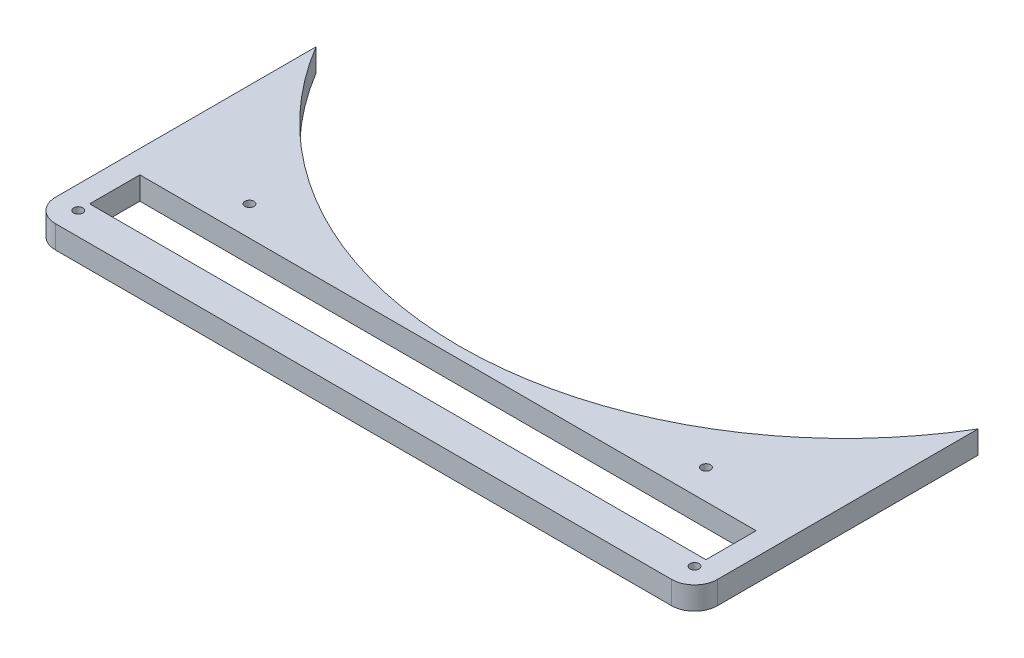
ISO-10303-21;
HEADER;
FILE_DESCRIPTION(('STEP AP214'),'2;1');
FILE_NAME('part.step','',(''),(''),'','','');
FILE_SCHEMA(('AUTOMOTIVE_DESIGN { 1 0 10303 214 1 1 1 1 }'));
ENDSEC;
DATA;
#1=APPLICATION_CONTEXT('core data for automotive mechanical design processes');
#2=APPLICATION_PROTOCOL_DEFINITION('international standard','automotive_design',2000,#1);
#3=PRODUCT_CONTEXT('',#1,'mechanical');
#4=PRODUCT('Part','Part','',(#3));
#5=PRODUCT_RELATED_PRODUCT_CATEGORY('part','',(#4));
#6=PRODUCT_DEFINITION_FORMATION('','',#4);
#7=PRODUCT_DEFINITION_CONTEXT('part definition',#1,'design');
#8=PRODUCT_DEFINITION('design','',#6,#7);
#9=PRODUCT_DEFINITION_SHAPE('','',#8);
#10=(LENGTH_UNIT() NAMED_UNIT(*) SI_UNIT(.MILLI.,.METRE.));
#11=(NAMED_UNIT(*) PLANE_ANGLE_UNIT() SI_UNIT($,.RADIAN.));
#12=(NAMED_UNIT(*) SI_UNIT($,.STERADIAN.) SOLID_ANGLE_UNIT());
#13=UNCERTAINTY_MEASURE_WITH_UNIT(LENGTH_MEASURE(1.E-05),#10,'distance_accuracy_value','');
#14=(GEOMETRIC_REPRESENTATION_CONTEXT(3) GLOBAL_UNCERTAINTY_ASSIGNED_CONTEXT((#13)) GLOBAL_UNIT_ASSIGNED_CONTEXT((#10,
#11,#12)) REPRESENTATION_CONTEXT('',''));
#15=CARTESIAN_POINT('',(0.,0.,0.));
#16=DIRECTION('',(0.,0.,1.));
#17=DIRECTION('',(1.,0.,0.));
#18=AXIS2_PLACEMENT_3D('',#15,#16,#17);
#19=CARTESIAN_POINT('',(280.,0.,-10.));
#20=DIRECTION('',(0.,1.,0.));
#21=DIRECTION('',(0.,0.,1.));
#22=AXIS2_PLACEMENT_3D('',#19,#20,#21);
#23=CYLINDRICAL_SURFACE('',#22,2.);
#24=CARTESIAN_POINT('',(280.,10.,-10.));
#25=DIRECTION('',(0.,1.,0.));
#26=DIRECTION('',(0.,0.,-1.));
#27=AXIS2_PLACEMENT_3D('',#24,#25,#26);
#28=CIRCLE('',#27,2.);
#29=CARTESIAN_POINT('',(280.,10.,-12.));
#30=VERTEX_POINT('',#29);
#31=EDGE_CURVE('E181',#30,#30,#28,.T.);
#32=ORIENTED_EDGE('',*,*,#31,.T.);
#33=EDGE_LOOP('',(#32));
#34=FACE_BOUND('',#33,.T.);
#35=CARTESIAN_POINT('',(280.,5.,-10.));
#36=DIRECTION('',(0.,-1.,0.));
#37=DIRECTION('',(0.,0.,-1.));
#38=AXIS2_PLACEMENT_3D('',#35,#36,#37);
#39=CIRCLE('',#38,2.);
#40=CARTESIAN_POINT('',(280.,5.,-12.));
#41=VERTEX_POINT('',#40);
#42=EDGE_CURVE('E142',#41,#41,#39,.F.);
#43=ORIENTED_EDGE('',*,*,#42,.F.);
#44=EDGE_LOOP('',(#43));
#45=FACE_BOUND('',#44,.T.);
#46=ADVANCED_FACE('F33',(#34,#45),#23,.F.);
#47=CARTESIAN_POINT('',(245.,0.,-50.));
#48=DIRECTION('',(0.,1.,0.));
#49=DIRECTION('',(0.,0.,1.));
#50=AXIS2_PLACEMENT_3D('',#47,#48,#49);
#51=CYLINDRICAL_SURFACE('',#50,2.00000000000002);
#52=CARTESIAN_POINT('',(245.,10.,-50.));
#53=DIRECTION('',(0.,1.,0.));
#54=DIRECTION('',(0.,0.,-1.));
#55=AXIS2_PLACEMENT_3D('',#52,#53,#54);
#56=CIRCLE('',#55,2.00000000000002);
#57=CARTESIAN_POINT('',(245.,10.,-52.));
#58=VERTEX_POINT('',#57);
#59=EDGE_CURVE('E276',#58,#58,#56,.T.);
#60=ORIENTED_EDGE('',*,*,#59,.T.);
#61=EDGE_LOOP('',(#60));
#62=FACE_BOUND('',#61,.T.);
#63=CARTESIAN_POINT('',(245.,5.,-50.));
#64=DIRECTION('',(0.,-1.,0.));
#65=DIRECTION('',(0.,0.,-1.));
#66=AXIS2_PLACEMENT_3D('',#63,#64,#65);
#67=CIRCLE('',#66,2.00000000000002);
#68=CARTESIAN_POINT('',(245.,5.,-52.));
#69=VERTEX_POINT('',#68);
#70=EDGE_CURVE('E237',#69,#69,#67,.F.);
#71=ORIENTED_EDGE('',*,*,#70,.F.);
#72=EDGE_LOOP('',(#71));
#73=FACE_BOUND('',#72,.T.);
#74=ADVANCED_FACE('F301',(#62,#73),#51,.F.);
#75=CARTESIAN_POINT('',(45.,0.,-50.));
#76=DIRECTION('',(0.,1.,0.));
#77=DIRECTION('',(0.,0.,1.));
#78=AXIS2_PLACEMENT_3D('',#75,#76,#77);
#79=CYLINDRICAL_SURFACE('',#78,2.);
#80=CARTESIAN_POINT('',(45.,10.,-50.));
#81=DIRECTION('',(0.,1.,0.));
#82=DIRECTION('',(0.,0.,1.));
#83=AXIS2_PLACEMENT_3D('',#80,#81,#82);
#84=CIRCLE('',#83,2.);
#85=CARTESIAN_POINT('',(45.,10.,-48.));
#86=VERTEX_POINT('',#85);
#87=EDGE_CURVE('E271',#86,#86,#84,.T.);
#88=ORIENTED_EDGE('',*,*,#87,.T.);
#89=EDGE_LOOP('',(#88));
#90=FACE_BOUND('',#89,.T.);
#91=CARTESIAN_POINT('',(45.,5.,-50.));
#92=DIRECTION('',(0.,-1.,0.));
#93=DIRECTION('',(0.,0.,-1.));
#94=AXIS2_PLACEMENT_3D('',#91,#92,#93);
#95=CIRCLE('',#94,2.);
#96=CARTESIAN_POINT('',(45.,5.,-52.));
#97=VERTEX_POINT('',#96);
#98=EDGE_CURVE('E232',#97,#97,#95,.F.);
#99=ORIENTED_EDGE('',*,*,#98,.F.);
#100=EDGE_LOOP('',(#99));
#101=FACE_BOUND('',#100,.T.);
#102=ADVANCED_FACE('F307',(#90,#101),#79,.F.);
#103=CARTESIAN_POINT('',(10.,0.,-10.));
#104=DIRECTION('',(0.,1.,0.));
#105=DIRECTION('',(0.,0.,1.));
#106=AXIS2_PLACEMENT_3D('',#103,#104,#105);
#107=CYLINDRICAL_SURFACE('',#106,2.);
#108=CARTESIAN_POINT('',(10.,10.,-10.));
#109=DIRECTION('',(0.,1.,0.));
#110=DIRECTION('',(0.,0.,1.));
#111=AXIS2_PLACEMENT_3D('',#108,#109,#110);
#112=CIRCLE('',#111,2.);
#113=CARTESIAN_POINT('',(10.,10.,-8.));
#114=VERTEX_POINT('',#113);
#115=EDGE_CURVE('E188',#114,#114,#112,.T.);
#116=ORIENTED_EDGE('',*,*,#115,.T.);
#117=EDGE_LOOP('',(#116));
#118=FACE_BOUND('',#117,.T.);
#119=CARTESIAN_POINT('',(10.,5.,-10.));
#120=DIRECTION('',(0.,-1.,0.));
#121=DIRECTION('',(0.,0.,-1.));
#122=AXIS2_PLACEMENT_3D('',#119,#120,#121);
#123=CIRCLE('',#122,2.);
#124=CARTESIAN_POINT('',(10.,5.,-12.));
#125=VERTEX_POINT('',#124);
#126=EDGE_CURVE('E281',#125,#125,#123,.F.);
#127=ORIENTED_EDGE('',*,*,#126,.F.);
#128=EDGE_LOOP('',(#127));
#129=FACE_BOUND('',#128,.T.);
#130=ADVANCED_FACE('F314',(#118,#129),#107,.F.);
#131=CARTESIAN_POINT('',(0.,10.,0.));
#132=DIRECTION('',(1.,0.,0.));
#133=DIRECTION('',(0.,0.,-1.));
#134=AXIS2_PLACEMENT_3D('',#131,#132,#133);
#135=PLANE('',#134);
#136=DIRECTION('',(0.,0.,1.));
#137=VECTOR('',#136,1.);
#138=CARTESIAN_POINT('',(0.,10.,0.));
#139=LINE('',#138,#137);
#140=CARTESIAN_POINT('',(0.,10.,-124.189862343157));
#141=VERTEX_POINT('',#140);
#142=CARTESIAN_POINT('',(0.,10.,-10.));
#143=VERTEX_POINT('',#142);
#144=EDGE_CURVE('E192',#141,#143,#139,.T.);
#145=ORIENTED_EDGE('',*,*,#144,.F.);
#146=DIRECTION('',(0.,-1.,0.));
#147=VECTOR('',#146,1.);
#148=CARTESIAN_POINT('',(0.,10.,-124.189862343157));
#149=LINE('',#148,#147);
#150=CARTESIAN_POINT('',(0.,0.,-124.189862343157));
#151=VERTEX_POINT('',#150);
#152=EDGE_CURVE('E171',#141,#151,#149,.T.);
#153=ORIENTED_EDGE('',*,*,#152,.T.);
#154=DIRECTION('',(0.,0.,1.));
#155=VECTOR('',#154,1.);
#156=CARTESIAN_POINT('',(0.,0.,0.));
#157=LINE('',#156,#155);
#158=CARTESIAN_POINT('',(0.,0.,-10.));
#159=VERTEX_POINT('',#158);
#160=EDGE_CURVE('E191',#151,#159,#157,.T.);
#161=ORIENTED_EDGE('',*,*,#160,.T.);
#162=DIRECTION('',(0.,-1.,0.));
#163=VECTOR('',#162,1.);
#164=CARTESIAN_POINT('',(0.,10.,-10.));
#165=LINE('',#164,#163);
#166=EDGE_CURVE('E217',#159,#143,#165,.F.);
#167=ORIENTED_EDGE('',*,*,#166,.T.);
#168=EDGE_LOOP('',(#145,#153,#161,#167));
#169=FACE_BOUND('',#168,.T.);
#170=ADVANCED_FACE('F317',(#169),#135,.F.);
#171=CARTESIAN_POINT('',(0.,10.,0.));
#172=DIRECTION('',(0.,0.,-1.));
#173=DIRECTION('',(-1.,0.,0.));
#174=AXIS2_PLACEMENT_3D('',#171,#172,#173);
#175=PLANE('',#174);
#176=DIRECTION('',(1.,0.,0.));
#177=VECTOR('',#176,1.);
#178=CARTESIAN_POINT('',(0.,10.,0.));
#179=LINE('',#178,#177);
#180=CARTESIAN_POINT('',(10.,10.,0.));
#181=VERTEX_POINT('',#180);
#182=CARTESIAN_POINT('',(280.,10.,0.));
#183=VERTEX_POINT('',#182);
#184=EDGE_CURVE('E194',#181,#183,#179,.T.);
#185=ORIENTED_EDGE('',*,*,#184,.F.);
#186=DIRECTION('',(0.,-1.,0.));
#187=VECTOR('',#186,1.);
#188=CARTESIAN_POINT('',(10.,10.,0.));
#189=LINE('',#188,#187);
#190=CARTESIAN_POINT('',(10.,0.,0.));
#191=VERTEX_POINT('',#190);
#192=EDGE_CURVE('E209',#181,#191,#189,.T.);
#193=ORIENTED_EDGE('',*,*,#192,.T.);
#194=DIRECTION('',(1.,0.,0.));
#195=VECTOR('',#194,1.);
#196=CARTESIAN_POINT('',(0.,0.,0.));
#197=LINE('',#196,#195);
#198=CARTESIAN_POINT('',(280.,0.,0.));
#199=VERTEX_POINT('',#198);
#200=EDGE_CURVE('E203',#191,#199,#197,.T.);
#201=ORIENTED_EDGE('',*,*,#200,.T.);
#202=DIRECTION('',(0.,-1.,0.));
#203=VECTOR('',#202,1.);
#204=CARTESIAN_POINT('',(280.,10.,0.));
#205=LINE('',#204,#203);
#206=EDGE_CURVE('E201',#199,#183,#205,.F.);
#207=ORIENTED_EDGE('',*,*,#206,.T.);
#208=EDGE_LOOP('',(#185,#193,#201,#207));
#209=FACE_BOUND('',#208,.T.);
#210=ADVANCED_FACE('F328',(#209),#175,.F.);
#211=CARTESIAN_POINT('',(290.,10.,0.));
#212=DIRECTION('',(-1.,0.,0.));
#213=DIRECTION('',(0.,0.,1.));
#214=AXIS2_PLACEMENT_3D('',#211,#212,#213);
#215=PLANE('',#214);
#216=DIRECTION('',(0.,0.,-1.));
#217=VECTOR('',#216,1.);
#218=CARTESIAN_POINT('',(290.,0.,0.));
#219=LINE('',#218,#217);
#220=CARTESIAN_POINT('',(290.,0.,-10.));
#221=VERTEX_POINT('',#220);
#222=CARTESIAN_POINT('',(290.,0.,-124.189862343157));
#223=VERTEX_POINT('',#222);
#224=EDGE_CURVE('E195',#221,#223,#219,.T.);
#225=ORIENTED_EDGE('',*,*,#224,.T.);
#226=DIRECTION('',(0.,-1.,0.));
#227=VECTOR('',#226,1.);
#228=CARTESIAN_POINT('',(290.,10.,-124.189862343157));
#229=LINE('',#228,#227);
#230=CARTESIAN_POINT('',(290.,10.,-124.189862343157));
#231=VERTEX_POINT('',#230);
#232=EDGE_CURVE('E264',#231,#223,#229,.T.);
#233=ORIENTED_EDGE('',*,*,#232,.F.);
#234=DIRECTION('',(0.,0.,-1.));
#235=VECTOR('',#234,1.);
#236=CARTESIAN_POINT('',(290.,10.,0.));
#237=LINE('',#236,#235);
#238=CARTESIAN_POINT('',(290.,10.,-10.));
#239=VERTEX_POINT('',#238);
#240=EDGE_CURVE('E198',#239,#231,#237,.T.);
#241=ORIENTED_EDGE('',*,*,#240,.F.);
#242=DIRECTION('',(0.,-1.,0.));
#243=VECTOR('',#242,1.);
#244=CARTESIAN_POINT('',(290.,10.,-10.));
#245=LINE('',#244,#243);
#246=EDGE_CURVE('E224',#239,#221,#245,.T.);
#247=ORIENTED_EDGE('',*,*,#246,.T.);
#248=EDGE_LOOP('',(#225,#233,#241,#247));
#249=FACE_BOUND('',#248,.T.);
#250=ADVANCED_FACE('F321',(#249),#215,.F.);
#251=CARTESIAN_POINT('',(0.,10.,0.));
#252=DIRECTION('',(0.,-1.,0.));
#253=DIRECTION('',(0.,0.,-1.));
#254=AXIS2_PLACEMENT_3D('',#251,#252,#253);
#255=PLANE('',#254);
#256=ORIENTED_EDGE('',*,*,#59,.F.);
#257=EDGE_LOOP('',(#256));
#258=FACE_BOUND('',#257,.T.);
#259=ORIENTED_EDGE('',*,*,#87,.F.);
#260=EDGE_LOOP('',(#259));
#261=FACE_BOUND('',#260,.T.);
#262=DIRECTION('',(1.,0.,0.));
#263=VECTOR('',#262,1.);
#264=CARTESIAN_POINT('',(9.99999999999998,10.,-15.));
#265=LINE('',#264,#263);
#266=CARTESIAN_POINT('',(9.99999999999998,10.,-15.));
#267=VERTEX_POINT('',#266);
#268=CARTESIAN_POINT('',(280.,10.,-15.));
#269=VERTEX_POINT('',#268);
#270=EDGE_CURVE('E170',#267,#269,#265,.T.);
#271=ORIENTED_EDGE('',*,*,#270,.F.);
#272=DIRECTION('',(0.,0.,1.));
#273=VECTOR('',#272,1.);
#274=CARTESIAN_POINT('',(9.99999999999998,10.,-37.));
#275=LINE('',#274,#273);
#276=CARTESIAN_POINT('',(9.99999999999998,10.,-37.));
#277=VERTEX_POINT('',#276);
#278=EDGE_CURVE('E167',#277,#267,#275,.T.);
#279=ORIENTED_EDGE('',*,*,#278,.F.);
#280=DIRECTION('',(-1.,0.,0.));
#281=VECTOR('',#280,1.);
#282=CARTESIAN_POINT('',(9.99999999999998,10.,-37.));
#283=LINE('',#282,#281);
#284=CARTESIAN_POINT('',(280.,10.,-37.));
#285=VERTEX_POINT('',#284);
#286=EDGE_CURVE('E176',#285,#277,#283,.T.);
#287=ORIENTED_EDGE('',*,*,#286,.F.);
#288=DIRECTION('',(0.,0.,-1.));
#289=VECTOR('',#288,1.);
#290=CARTESIAN_POINT('',(280.,10.,-37.));
#291=LINE('',#290,#289);
#292=EDGE_CURVE('E174',#269,#285,#291,.T.);
#293=ORIENTED_EDGE('',*,*,#292,.F.);
#294=EDGE_LOOP('',(#271,#279,#287,#293));
#295=FACE_BOUND('',#294,.T.);
#296=ORIENTED_EDGE('',*,*,#31,.F.);
#297=EDGE_LOOP('',(#296));
#298=FACE_BOUND('',#297,.T.);
#299=ORIENTED_EDGE('',*,*,#115,.F.);
#300=EDGE_LOOP('',(#299));
#301=FACE_BOUND('',#300,.T.);
#302=ORIENTED_EDGE('',*,*,#240,.T.);
#303=CARTESIAN_POINT('',(145.,10.,-211.));
#304=DIRECTION('',(0.,-1.,0.));
#305=DIRECTION('',(0.,0.,-1.));
#306=AXIS2_PLACEMENT_3D('',#303,#304,#305);
#307=CIRCLE('',#306,169.);
#308=EDGE_CURVE('E266',#231,#141,#307,.T.);
#309=ORIENTED_EDGE('',*,*,#308,.T.);
#310=ORIENTED_EDGE('',*,*,#144,.T.);
#311=CARTESIAN_POINT('',(10.,10.,-10.));
#312=DIRECTION('',(0.,-1.,0.));
#313=DIRECTION('',(0.,0.,-1.));
#314=AXIS2_PLACEMENT_3D('',#311,#312,#313);
#315=CIRCLE('',#314,10.);
#316=EDGE_CURVE('E222',#143,#181,#315,.F.);
#317=ORIENTED_EDGE('',*,*,#316,.T.);
#318=ORIENTED_EDGE('',*,*,#184,.T.);
#319=CARTESIAN_POINT('',(280.,10.,-10.));
#320=DIRECTION('',(0.,-1.,0.));
#321=DIRECTION('',(0.,0.,-1.));
#322=AXIS2_PLACEMENT_3D('',#319,#320,#321);
#323=CIRCLE('',#322,10.);
#324=EDGE_CURVE('E220',#183,#239,#323,.F.);
#325=ORIENTED_EDGE('',*,*,#324,.T.);
#326=EDGE_LOOP('',(#302,#309,#310,#317,#318,#325));
#327=FACE_BOUND('',#326,.T.);
#328=ADVANCED_FACE('F255',(#258,#261,#295,#298,#301,#327),#255,.F.);
#329=CARTESIAN_POINT('',(0.,0.,0.));
#330=DIRECTION('',(0.,-1.,0.));
#331=DIRECTION('',(0.,0.,-1.));
#332=AXIS2_PLACEMENT_3D('',#329,#330,#331);
#333=PLANE('',#332);
#334=CARTESIAN_POINT('',(280.,0.,-10.));
#335=DIRECTION('',(0.,-1.,0.));
#336=DIRECTION('',(0.,0.,-1.));
#337=AXIS2_PLACEMENT_3D('',#334,#335,#336);
#338=CIRCLE('',#337,5.99999999999999);
#339=CARTESIAN_POINT('',(280.,0.,-16.));
#340=VERTEX_POINT('',#339);
#341=CARTESIAN_POINT('',(276.683375209645,0.,-15.));
#342=VERTEX_POINT('',#341);
#343=EDGE_CURVE('E137',#340,#342,#338,.T.);
#344=ORIENTED_EDGE('',*,*,#343,.F.);
#345=DIRECTION('',(0.,0.,-1.));
#346=VECTOR('',#345,1.);
#347=CARTESIAN_POINT('',(280.,0.,-37.));
#348=LINE('',#347,#346);
#349=CARTESIAN_POINT('',(280.,0.,-37.));
#350=VERTEX_POINT('',#349);
#351=EDGE_CURVE('E149',#340,#350,#348,.T.);
#352=ORIENTED_EDGE('',*,*,#351,.T.);
#353=DIRECTION('',(-1.,0.,0.));
#354=VECTOR('',#353,1.);
#355=CARTESIAN_POINT('',(9.99999999999998,0.,-37.));
#356=LINE('',#355,#354);
#357=CARTESIAN_POINT('',(9.99999999999998,0.,-37.));
#358=VERTEX_POINT('',#357);
#359=EDGE_CURVE('E159',#350,#358,#356,.T.);
#360=ORIENTED_EDGE('',*,*,#359,.T.);
#361=DIRECTION('',(0.,0.,1.));
#362=VECTOR('',#361,1.);
#363=CARTESIAN_POINT('',(9.99999999999998,0.,-37.));
#364=LINE('',#363,#362);
#365=CARTESIAN_POINT('',(9.99999999999998,0.,-16.));
#366=VERTEX_POINT('',#365);
#367=EDGE_CURVE('E163',#358,#366,#364,.T.);
#368=ORIENTED_EDGE('',*,*,#367,.T.);
#369=CARTESIAN_POINT('',(10.,0.,-10.));
#370=DIRECTION('',(0.,-1.,0.));
#371=DIRECTION('',(0.,0.,-1.));
#372=AXIS2_PLACEMENT_3D('',#369,#370,#371);
#373=CIRCLE('',#372,6.);
#374=CARTESIAN_POINT('',(13.3166247903554,0.,-15.));
#375=VERTEX_POINT('',#374);
#376=EDGE_CURVE('E235',#375,#366,#373,.T.);
#377=ORIENTED_EDGE('',*,*,#376,.F.);
#378=DIRECTION('',(1.,0.,0.));
#379=VECTOR('',#378,1.);
#380=CARTESIAN_POINT('',(9.99999999999998,0.,-15.));
#381=LINE('',#380,#379);
#382=EDGE_CURVE('E153',#375,#342,#381,.T.);
#383=ORIENTED_EDGE('',*,*,#382,.T.);
#384=EDGE_LOOP('',(#344,#352,#360,#368,#377,#383));
#385=FACE_BOUND('',#384,.T.);
#386=CARTESIAN_POINT('',(245.,0.,-50.));
#387=DIRECTION('',(0.,-1.,0.));
#388=DIRECTION('',(0.,0.,-1.));
#389=AXIS2_PLACEMENT_3D('',#386,#387,#388);
#390=CIRCLE('',#389,5.99999999999999);
#391=CARTESIAN_POINT('',(245.,0.,-56.));
#392=VERTEX_POINT('',#391);
#393=EDGE_CURVE('E141',#392,#392,#390,.T.);
#394=ORIENTED_EDGE('',*,*,#393,.F.);
#395=EDGE_LOOP('',(#394));
#396=FACE_BOUND('',#395,.T.);
#397=CARTESIAN_POINT('',(45.,0.,-50.));
#398=DIRECTION('',(0.,-1.,0.));
#399=DIRECTION('',(0.,0.,-1.));
#400=AXIS2_PLACEMENT_3D('',#397,#398,#399);
#401=CIRCLE('',#400,6.);
#402=CARTESIAN_POINT('',(45.,0.,-56.));
#403=VERTEX_POINT('',#402);
#404=EDGE_CURVE('E239',#403,#403,#401,.T.);
#405=ORIENTED_EDGE('',*,*,#404,.F.);
#406=EDGE_LOOP('',(#405));
#407=FACE_BOUND('',#406,.T.);
#408=CARTESIAN_POINT('',(145.,0.,-211.));
#409=DIRECTION('',(0.,-1.,0.));
#410=DIRECTION('',(0.,0.,-1.));
#411=AXIS2_PLACEMENT_3D('',#408,#409,#410);
#412=CIRCLE('',#411,169.);
#413=EDGE_CURVE('E269',#223,#151,#412,.T.);
#414=ORIENTED_EDGE('',*,*,#413,.F.);
#415=ORIENTED_EDGE('',*,*,#224,.F.);
#416=CARTESIAN_POINT('',(280.,0.,-10.));
#417=DIRECTION('',(0.,-1.,0.));
#418=DIRECTION('',(0.,0.,-1.));
#419=AXIS2_PLACEMENT_3D('',#416,#417,#418);
#420=CIRCLE('',#419,10.);
#421=EDGE_CURVE('E212',#221,#199,#420,.T.);
#422=ORIENTED_EDGE('',*,*,#421,.T.);
#423=ORIENTED_EDGE('',*,*,#200,.F.);
#424=CARTESIAN_POINT('',(10.,0.,-10.));
#425=DIRECTION('',(0.,-1.,0.));
#426=DIRECTION('',(0.,0.,-1.));
#427=AXIS2_PLACEMENT_3D('',#424,#425,#426);
#428=CIRCLE('',#427,10.);
#429=EDGE_CURVE('E214',#191,#159,#428,.T.);
#430=ORIENTED_EDGE('',*,*,#429,.T.);
#431=ORIENTED_EDGE('',*,*,#160,.F.);
#432=EDGE_LOOP('',(#414,#415,#422,#423,#430,#431));
#433=FACE_BOUND('',#432,.T.);
#434=ADVANCED_FACE('F146',(#385,#396,#407,#433),#333,.T.);
#435=CARTESIAN_POINT('',(10.,10.,-10.));
#436=DIRECTION('',(0.,-1.,0.));
#437=DIRECTION('',(0.,0.,-1.));
#438=AXIS2_PLACEMENT_3D('',#435,#436,#437);
#439=CYLINDRICAL_SURFACE('',#438,10.);
#440=ORIENTED_EDGE('',*,*,#316,.F.);
#441=ORIENTED_EDGE('',*,*,#166,.F.);
#442=ORIENTED_EDGE('',*,*,#429,.F.);
#443=ORIENTED_EDGE('',*,*,#192,.F.);
#444=EDGE_LOOP('',(#440,#441,#442,#443));
#445=FACE_BOUND('',#444,.T.);
#446=ADVANCED_FACE('F325',(#445),#439,.T.);
#447=CARTESIAN_POINT('',(280.,10.,-10.));
#448=DIRECTION('',(0.,-1.,0.));
#449=DIRECTION('',(0.,0.,-1.));
#450=AXIS2_PLACEMENT_3D('',#447,#448,#449);
#451=CYLINDRICAL_SURFACE('',#450,10.);
#452=ORIENTED_EDGE('',*,*,#324,.F.);
#453=ORIENTED_EDGE('',*,*,#206,.F.);
#454=ORIENTED_EDGE('',*,*,#421,.F.);
#455=ORIENTED_EDGE('',*,*,#246,.F.);
#456=EDGE_LOOP('',(#452,#453,#454,#455));
#457=FACE_BOUND('',#456,.T.);
#458=ADVANCED_FACE('F35',(#457),#451,.T.);
#459=CARTESIAN_POINT('',(9.99999999999998,0.,-37.));
#460=DIRECTION('',(-1.,0.,0.));
#461=DIRECTION('',(0.,0.,1.));
#462=AXIS2_PLACEMENT_3D('',#459,#460,#461);
#463=PLANE('',#462);
#464=DIRECTION('',(0.,0.,1.));
#465=VECTOR('',#464,1.);
#466=CARTESIAN_POINT('',(9.99999999999998,5.,-37.));
#467=LINE('',#466,#465);
#468=CARTESIAN_POINT('',(9.99999999999998,5.,-16.));
#469=VERTEX_POINT('',#468);
#470=CARTESIAN_POINT('',(9.99999999999998,5.,-15.));
#471=VERTEX_POINT('',#470);
#472=EDGE_CURVE('E56',#469,#471,#467,.T.);
#473=ORIENTED_EDGE('',*,*,#472,.F.);
#474=DIRECTION('',(0.,-1.,0.));
#475=VECTOR('',#474,1.);
#476=CARTESIAN_POINT('',(9.99999999999998,5.,-16.));
#477=LINE('',#476,#475);
#478=EDGE_CURVE('E279',#469,#366,#477,.T.);
#479=ORIENTED_EDGE('',*,*,#478,.T.);
#480=ORIENTED_EDGE('',*,*,#367,.F.);
#481=DIRECTION('',(0.,1.,0.));
#482=VECTOR('',#481,1.);
#483=CARTESIAN_POINT('',(9.99999999999998,0.,-37.));
#484=LINE('',#483,#482);
#485=EDGE_CURVE('E179',#358,#277,#484,.T.);
#486=ORIENTED_EDGE('',*,*,#485,.T.);
#487=ORIENTED_EDGE('',*,*,#278,.T.);
#488=DIRECTION('',(0.,1.,0.));
#489=VECTOR('',#488,1.);
#490=CARTESIAN_POINT('',(9.99999999999998,0.,-15.));
#491=LINE('',#490,#489);
#492=EDGE_CURVE('E161',#471,#267,#491,.T.);
#493=ORIENTED_EDGE('',*,*,#492,.F.);
#494=EDGE_LOOP('',(#473,#479,#480,#486,#487,#493));
#495=FACE_BOUND('',#494,.T.);
#496=ADVANCED_FACE('F312',(#495),#463,.F.);
#497=CARTESIAN_POINT('',(9.99999999999998,0.,-37.));
#498=DIRECTION('',(0.,0.,-1.));
#499=DIRECTION('',(-1.,0.,0.));
#500=AXIS2_PLACEMENT_3D('',#497,#498,#499);
#501=PLANE('',#500);
#502=ORIENTED_EDGE('',*,*,#286,.T.);
#503=ORIENTED_EDGE('',*,*,#485,.F.);
#504=ORIENTED_EDGE('',*,*,#359,.F.);
#505=DIRECTION('',(0.,1.,0.));
#506=VECTOR('',#505,1.);
#507=CARTESIAN_POINT('',(280.,0.,-37.));
#508=LINE('',#507,#506);
#509=EDGE_CURVE('E157',#350,#285,#508,.T.);
#510=ORIENTED_EDGE('',*,*,#509,.T.);
#511=EDGE_LOOP('',(#502,#503,#504,#510));
#512=FACE_BOUND('',#511,.T.);
#513=ADVANCED_FACE('F258',(#512),#501,.F.);
#514=CARTESIAN_POINT('',(280.,0.,-37.));
#515=DIRECTION('',(1.,0.,0.));
#516=DIRECTION('',(0.,0.,-1.));
#517=AXIS2_PLACEMENT_3D('',#514,#515,#516);
#518=PLANE('',#517);
#519=ORIENTED_EDGE('',*,*,#351,.F.);
#520=DIRECTION('',(0.,-1.,0.));
#521=VECTOR('',#520,1.);
#522=CARTESIAN_POINT('',(280.,5.,-16.));
#523=LINE('',#522,#521);
#524=CARTESIAN_POINT('',(280.,5.,-16.));
#525=VERTEX_POINT('',#524);
#526=EDGE_CURVE('E134',#340,#525,#523,.F.);
#527=ORIENTED_EDGE('',*,*,#526,.T.);
#528=DIRECTION('',(0.,0.,-1.));
#529=VECTOR('',#528,1.);
#530=CARTESIAN_POINT('',(280.,5.,-37.));
#531=LINE('',#530,#529);
#532=CARTESIAN_POINT('',(280.,5.,-15.));
#533=VERTEX_POINT('',#532);
#534=EDGE_CURVE('E244',#533,#525,#531,.T.);
#535=ORIENTED_EDGE('',*,*,#534,.F.);
#536=DIRECTION('',(0.,1.,0.));
#537=VECTOR('',#536,1.);
#538=CARTESIAN_POINT('',(280.,0.,-15.));
#539=LINE('',#538,#537);
#540=EDGE_CURVE('E183',#533,#269,#539,.T.);
#541=ORIENTED_EDGE('',*,*,#540,.T.);
#542=ORIENTED_EDGE('',*,*,#292,.T.);
#543=ORIENTED_EDGE('',*,*,#509,.F.);
#544=EDGE_LOOP('',(#519,#527,#535,#541,#542,#543));
#545=FACE_BOUND('',#544,.T.);
#546=ADVANCED_FACE('F155',(#545),#518,.F.);
#547=CARTESIAN_POINT('',(9.99999999999998,0.,-15.));
#548=DIRECTION('',(0.,0.,1.));
#549=DIRECTION('',(1.,0.,0.));
#550=AXIS2_PLACEMENT_3D('',#547,#548,#549);
#551=PLANE('',#550);
#552=DIRECTION('',(1.,0.,0.));
#553=VECTOR('',#552,1.);
#554=CARTESIAN_POINT('',(9.99999999999998,5.,-15.));
#555=LINE('',#554,#553);
#556=CARTESIAN_POINT('',(276.683375209645,5.,-15.));
#557=VERTEX_POINT('',#556);
#558=EDGE_CURVE('E41',#557,#533,#555,.T.);
#559=ORIENTED_EDGE('',*,*,#558,.F.);
#560=DIRECTION('',(0.,-1.,0.));
#561=VECTOR('',#560,1.);
#562=CARTESIAN_POINT('',(276.683375209645,5.,-15.));
#563=LINE('',#562,#561);
#564=EDGE_CURVE('E11',#557,#342,#563,.T.);
#565=ORIENTED_EDGE('',*,*,#564,.T.);
#566=ORIENTED_EDGE('',*,*,#382,.F.);
#567=DIRECTION('',(0.,-1.,0.));
#568=VECTOR('',#567,1.);
#569=CARTESIAN_POINT('',(13.3166247903554,5.,-15.));
#570=LINE('',#569,#568);
#571=CARTESIAN_POINT('',(13.3166247903554,5.,-15.));
#572=VERTEX_POINT('',#571);
#573=EDGE_CURVE('E229',#375,#572,#570,.F.);
#574=ORIENTED_EDGE('',*,*,#573,.T.);
#575=DIRECTION('',(1.,0.,0.));
#576=VECTOR('',#575,1.);
#577=CARTESIAN_POINT('',(9.99999999999998,5.,-15.));
#578=LINE('',#577,#576);
#579=EDGE_CURVE('E227',#471,#572,#578,.T.);
#580=ORIENTED_EDGE('',*,*,#579,.F.);
#581=ORIENTED_EDGE('',*,*,#492,.T.);
#582=ORIENTED_EDGE('',*,*,#270,.T.);
#583=ORIENTED_EDGE('',*,*,#540,.F.);
#584=EDGE_LOOP('',(#559,#565,#566,#574,#580,#581,#582,#583));
#585=FACE_BOUND('',#584,.T.);
#586=ADVANCED_FACE('F248',(#585),#551,.F.);
#587=CARTESIAN_POINT('',(145.,10.,-211.));
#588=DIRECTION('',(0.,-1.,0.));
#589=DIRECTION('',(0.,0.,-1.));
#590=AXIS2_PLACEMENT_3D('',#587,#588,#589);
#591=CYLINDRICAL_SURFACE('',#590,169.);
#592=ORIENTED_EDGE('',*,*,#413,.T.);
#593=ORIENTED_EDGE('',*,*,#152,.F.);
#594=ORIENTED_EDGE('',*,*,#308,.F.);
#595=ORIENTED_EDGE('',*,*,#232,.T.);
#596=EDGE_LOOP('',(#592,#593,#594,#595));
#597=FACE_BOUND('',#596,.T.);
#598=ADVANCED_FACE('F356',(#597),#591,.F.);
#599=CARTESIAN_POINT('',(10.,5.,-10.));
#600=DIRECTION('',(0.,-1.,0.));
#601=DIRECTION('',(0.,0.,-1.));
#602=AXIS2_PLACEMENT_3D('',#599,#600,#601);
#603=CYLINDRICAL_SURFACE('',#602,6.);
#604=CARTESIAN_POINT('',(10.,5.,-10.));
#605=DIRECTION('',(0.,-1.,0.));
#606=DIRECTION('',(0.,0.,-1.));
#607=AXIS2_PLACEMENT_3D('',#604,#605,#606);
#608=CIRCLE('',#607,6.);
#609=EDGE_CURVE('E285',#572,#469,#608,.T.);
#610=ORIENTED_EDGE('',*,*,#609,.F.);
#611=ORIENTED_EDGE('',*,*,#573,.F.);
#612=ORIENTED_EDGE('',*,*,#376,.T.);
#613=ORIENTED_EDGE('',*,*,#478,.F.);
#614=EDGE_LOOP('',(#610,#611,#612,#613));
#615=FACE_BOUND('',#614,.T.);
#616=ADVANCED_FACE('F360',(#615),#603,.F.);
#617=CARTESIAN_POINT('',(10.,5.,-10.));
#618=DIRECTION('',(0.,-1.,0.));
#619=DIRECTION('',(0.,0.,-1.));
#620=AXIS2_PLACEMENT_3D('',#617,#618,#619);
#621=PLANE('',#620);
#622=ORIENTED_EDGE('',*,*,#472,.T.);
#623=ORIENTED_EDGE('',*,*,#579,.T.);
#624=ORIENTED_EDGE('',*,*,#609,.T.);
#625=EDGE_LOOP('',(#622,#623,#624));
#626=FACE_BOUND('',#625,.T.);
#627=ORIENTED_EDGE('',*,*,#126,.T.);
#628=EDGE_LOOP('',(#627));
#629=FACE_BOUND('',#628,.T.);
#630=ADVANCED_FACE('F366',(#626,#629),#621,.T.);
#631=CARTESIAN_POINT('',(45.,5.,-50.));
#632=DIRECTION('',(0.,-1.,0.));
#633=DIRECTION('',(0.,0.,-1.));
#634=AXIS2_PLACEMENT_3D('',#631,#632,#633);
#635=PLANE('',#634);
#636=CARTESIAN_POINT('',(45.,5.,-50.));
#637=DIRECTION('',(0.,-1.,0.));
#638=DIRECTION('',(0.,0.,-1.));
#639=AXIS2_PLACEMENT_3D('',#636,#637,#638);
#640=CIRCLE('',#639,6.);
#641=CARTESIAN_POINT('',(45.,5.,-56.));
#642=VERTEX_POINT('',#641);
#643=EDGE_CURVE('E236',#642,#642,#640,.T.);
#644=ORIENTED_EDGE('',*,*,#643,.T.);
#645=EDGE_LOOP('',(#644));
#646=FACE_BOUND('',#645,.T.);
#647=ORIENTED_EDGE('',*,*,#98,.T.);
#648=EDGE_LOOP('',(#647));
#649=FACE_BOUND('',#648,.T.);
#650=ADVANCED_FACE('F401',(#646,#649),#635,.T.);
#651=CARTESIAN_POINT('',(45.,5.,-50.));
#652=DIRECTION('',(0.,-1.,0.));
#653=DIRECTION('',(0.,0.,-1.));
#654=AXIS2_PLACEMENT_3D('',#651,#652,#653);
#655=CYLINDRICAL_SURFACE('',#654,6.);
#656=ORIENTED_EDGE('',*,*,#643,.F.);
#657=EDGE_LOOP('',(#656));
#658=FACE_BOUND('',#657,.T.);
#659=ORIENTED_EDGE('',*,*,#404,.T.);
#660=EDGE_LOOP('',(#659));
#661=FACE_BOUND('',#660,.T.);
#662=ADVANCED_FACE('F410',(#658,#661),#655,.F.);
#663=CARTESIAN_POINT('',(245.,5.,-50.));
#664=DIRECTION('',(0.,-1.,0.));
#665=DIRECTION('',(0.,0.,-1.));
#666=AXIS2_PLACEMENT_3D('',#663,#664,#665);
#667=PLANE('',#666);
#668=CARTESIAN_POINT('',(245.,5.,-50.));
#669=DIRECTION('',(0.,-1.,0.));
#670=DIRECTION('',(0.,0.,-1.));
#671=AXIS2_PLACEMENT_3D('',#668,#669,#670);
#672=CIRCLE('',#671,5.99999999999999);
#673=CARTESIAN_POINT('',(245.,5.,-56.));
#674=VERTEX_POINT('',#673);
#675=EDGE_CURVE('E240',#674,#674,#672,.T.);
#676=ORIENTED_EDGE('',*,*,#675,.T.);
#677=EDGE_LOOP('',(#676));
#678=FACE_BOUND('',#677,.T.);
#679=ORIENTED_EDGE('',*,*,#70,.T.);
#680=EDGE_LOOP('',(#679));
#681=FACE_BOUND('',#680,.T.);
#682=ADVANCED_FACE('F420',(#678,#681),#667,.T.);
#683=CARTESIAN_POINT('',(245.,5.,-50.));
#684=DIRECTION('',(0.,-1.,0.));
#685=DIRECTION('',(0.,0.,-1.));
#686=AXIS2_PLACEMENT_3D('',#683,#684,#685);
#687=CYLINDRICAL_SURFACE('',#686,5.99999999999999);
#688=ORIENTED_EDGE('',*,*,#675,.F.);
#689=EDGE_LOOP('',(#688));
#690=FACE_BOUND('',#689,.T.);
#691=ORIENTED_EDGE('',*,*,#393,.T.);
#692=EDGE_LOOP('',(#691));
#693=FACE_BOUND('',#692,.T.);
#694=ADVANCED_FACE('F430',(#690,#693),#687,.F.);
#695=CARTESIAN_POINT('',(280.,5.,-10.));
#696=DIRECTION('',(0.,-1.,0.));
#697=DIRECTION('',(0.,0.,-1.));
#698=AXIS2_PLACEMENT_3D('',#695,#696,#697);
#699=CYLINDRICAL_SURFACE('',#698,5.99999999999999);
#700=ORIENTED_EDGE('',*,*,#343,.T.);
#701=ORIENTED_EDGE('',*,*,#564,.F.);
#702=CARTESIAN_POINT('',(280.,5.,-10.));
#703=DIRECTION('',(0.,-1.,0.));
#704=DIRECTION('',(0.,0.,-1.));
#705=AXIS2_PLACEMENT_3D('',#702,#703,#704);
#706=CIRCLE('',#705,5.99999999999999);
#707=EDGE_CURVE('E48',#525,#557,#706,.T.);
#708=ORIENTED_EDGE('',*,*,#707,.F.);
#709=ORIENTED_EDGE('',*,*,#526,.F.);
#710=EDGE_LOOP('',(#700,#701,#708,#709));
#711=FACE_BOUND('',#710,.T.);
#712=ADVANCED_FACE('F136',(#711),#699,.F.);
#713=CARTESIAN_POINT('',(280.,5.,-10.));
#714=DIRECTION('',(0.,-1.,0.));
#715=DIRECTION('',(0.,0.,-1.));
#716=AXIS2_PLACEMENT_3D('',#713,#714,#715);
#717=PLANE('',#716);
#718=ORIENTED_EDGE('',*,*,#534,.T.);
#719=ORIENTED_EDGE('',*,*,#707,.T.);
#720=ORIENTED_EDGE('',*,*,#558,.T.);
#721=EDGE_LOOP('',(#718,#719,#720));
#722=FACE_BOUND('',#721,.T.);
#723=ORIENTED_EDGE('',*,*,#42,.T.);
#724=EDGE_LOOP('',(#723));
#725=FACE_BOUND('',#724,.T.);
#726=ADVANCED_FACE('F242',(#722,#725),#717,.T.);
#727=CLOSED_SHELL('',(#46,#74,#102,#130,#170,#210,#250,#328,#434,#446,#458,#496,#513,#546,#586,
#598,#616,#630,#650,#662,#682,#694,#712,#726));
#728=MANIFOLD_SOLID_BREP('B2',#727);
#729=ADVANCED_BREP_SHAPE_REPRESENTATION('',(#18,#728),#14);
#730=SHAPE_DEFINITION_REPRESENTATION(#9,#729);
ENDSEC;
END-ISO-10303-21;
